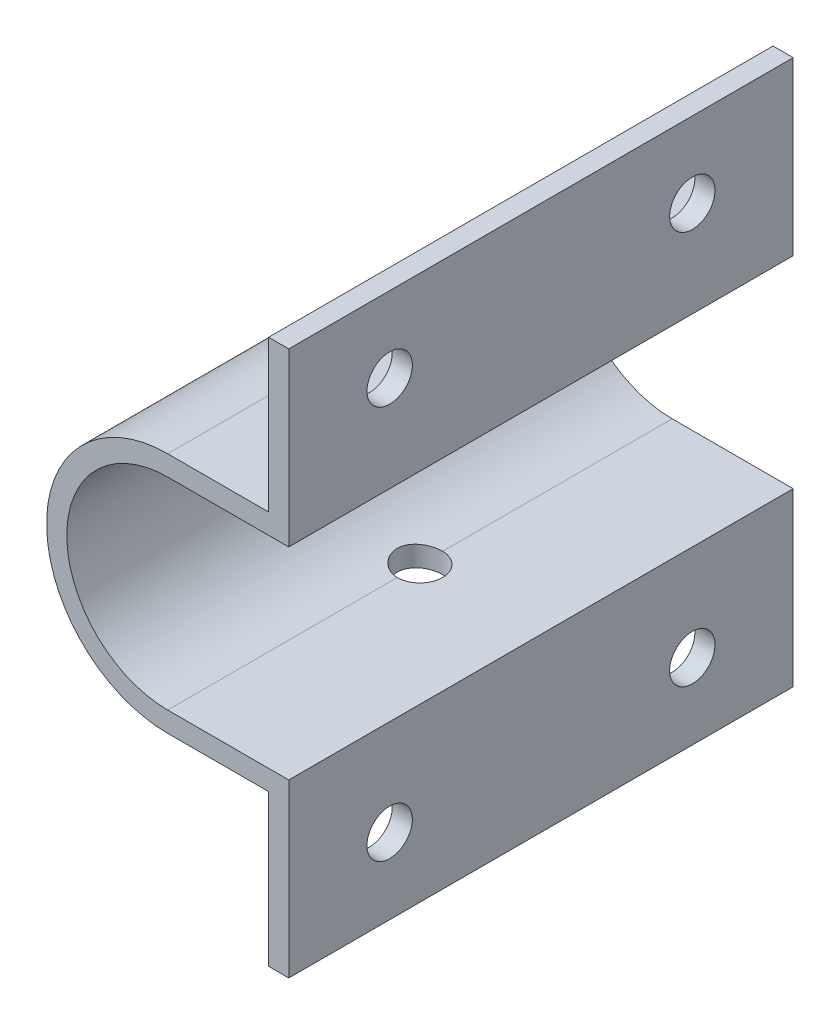
ISO-10303-21;
HEADER;
FILE_DESCRIPTION(('STEP AP214'),'2;1');
FILE_NAME('part.step','',(''),(''),'','','');
FILE_SCHEMA(('AUTOMOTIVE_DESIGN { 1 0 10303 214 1 1 1 1 }'));
ENDSEC;
DATA;
#1=APPLICATION_CONTEXT('core data for automotive mechanical design processes');
#2=APPLICATION_PROTOCOL_DEFINITION('international standard','automotive_design',2000,#1);
#3=PRODUCT_CONTEXT('',#1,'mechanical');
#4=PRODUCT('Part','Part','',(#3));
#5=PRODUCT_RELATED_PRODUCT_CATEGORY('part','',(#4));
#6=PRODUCT_DEFINITION_FORMATION('','',#4);
#7=PRODUCT_DEFINITION_CONTEXT('part definition',#1,'design');
#8=PRODUCT_DEFINITION('design','',#6,#7);
#9=PRODUCT_DEFINITION_SHAPE('','',#8);
#10=(LENGTH_UNIT() NAMED_UNIT(*) SI_UNIT(.MILLI.,.METRE.));
#11=(NAMED_UNIT(*) PLANE_ANGLE_UNIT() SI_UNIT($,.RADIAN.));
#12=(NAMED_UNIT(*) SI_UNIT($,.STERADIAN.) SOLID_ANGLE_UNIT());
#13=UNCERTAINTY_MEASURE_WITH_UNIT(LENGTH_MEASURE(1.E-05),#10,'distance_accuracy_value','');
#14=(GEOMETRIC_REPRESENTATION_CONTEXT(3) GLOBAL_UNCERTAINTY_ASSIGNED_CONTEXT((#13)) GLOBAL_UNIT_ASSIGNED_CONTEXT((#10,
#11,#12)) REPRESENTATION_CONTEXT('',''));
#15=CARTESIAN_POINT('',(0.,0.,0.));
#16=DIRECTION('',(0.,0.,1.));
#17=DIRECTION('',(1.,0.,0.));
#18=AXIS2_PLACEMENT_3D('',#15,#16,#17);
#19=CARTESIAN_POINT('',(0.,0.,50.));
#20=DIRECTION('',(0.,0.,-1.));
#21=DIRECTION('',(-1.,0.,0.));
#22=AXIS2_PLACEMENT_3D('',#19,#20,#21);
#23=CYLINDRICAL_SURFACE('',#22,10.);
#24=DIRECTION('',(0.,0.,-1.));
#25=VECTOR('',#24,1.);
#26=CARTESIAN_POINT('',(0.,10.,50.));
#27=LINE('',#26,#25);
#28=CARTESIAN_POINT('',(0.,10.,22.75));
#29=VERTEX_POINT('',#28);
#30=CARTESIAN_POINT('',(0.,10.,0.));
#31=VERTEX_POINT('',#30);
#32=EDGE_CURVE('E188',#29,#31,#27,.T.);
#33=ORIENTED_EDGE('',*,*,#32,.F.);
#34=CARTESIAN_POINT('',(0.,10.,22.75));
#35=CARTESIAN_POINT('',(-0.0624470447693873,10.0000055875236,22.749993056378));
#36=CARTESIAN_POINT('',(-0.124890204381189,9.99941517885063,22.75259966788));
#37=CARTESIAN_POINT('',(-0.249314903291551,9.99708377835417,22.7629861519145));
#38=CARTESIAN_POINT('',(-0.311296504304625,9.9953429432515,22.7707653197984));
#39=CARTESIAN_POINT('',(-0.43425777653705,9.99075594710814,22.7914256683882));
#40=CARTESIAN_POINT('',(-0.495238960421022,9.98791165403444,22.8042982275767));
#41=CARTESIAN_POINT('',(-0.615857084081694,9.98120113497269,22.8350291660513));
#42=CARTESIAN_POINT('',(-0.675494015065229,9.97733490230192,22.8528875779413));
#43=CARTESIAN_POINT('',(-0.85176921545323,9.96435191523754,22.913757729114));
#44=CARTESIAN_POINT('',(-0.96587678485342,9.9538466954166,22.9640821551381));
#45=CARTESIAN_POINT('',(-1.18398334570549,9.93027011933023,23.082678485921));
#46=CARTESIAN_POINT('',(-1.28798073581531,9.91719835753943,23.1509532274906));
#47=CARTESIAN_POINT('',(-1.48472488474375,9.88967180925127,23.3047405357436));
#48=CARTESIAN_POINT('',(-1.57727887743453,9.8751991766953,23.3904969495237));
#49=CARTESIAN_POINT('',(-1.74682120879686,9.84662524765225,23.576293756852));
#50=CARTESIAN_POINT('',(-1.82380682487077,9.83252401649023,23.6763366436084));
#51=CARTESIAN_POINT('',(-1.96089210296835,9.80611277589258,23.8893141415649));
#52=CARTESIAN_POINT('',(-2.02078278329098,9.79382575368215,24.0023863861688));
#53=CARTESIAN_POINT('',(-2.12063238799091,9.77269362016971,24.2373067141751));
#54=CARTESIAN_POINT('',(-2.16059490853669,9.7638478879275,24.3591532096608));
#55=CARTESIAN_POINT('',(-2.21881227334637,9.75078233375005,24.6060535000212));
#56=CARTESIAN_POINT('',(-2.23741248910662,9.7464890018169,24.7310218831118));
#57=CARTESIAN_POINT('',(-2.2534515068273,9.74279371034671,24.9823763533231));
#58=CARTESIAN_POINT('',(-2.25089258067435,9.74339122567249,25.1087622867843));
#59=CARTESIAN_POINT('',(-2.22496268171188,9.74934383403241,25.3567755076587));
#60=CARTESIAN_POINT('',(-2.20199539269521,9.75460664134083,25.4784475530561));
#61=CARTESIAN_POINT('',(-2.13654131808084,9.76915066186977,25.716165024114));
#62=CARTESIAN_POINT('',(-2.09405353824206,9.77843207976962,25.8322101628452));
#63=CARTESIAN_POINT('',(-1.99039842085379,9.80005744689505,26.0565072049556));
#64=CARTESIAN_POINT('',(-1.92907726476226,9.81242645163413,26.1646855067948));
#65=CARTESIAN_POINT('',(-1.78960562354948,9.83881772235586,26.3693621599014));
#66=CARTESIAN_POINT('',(-1.71145319075238,9.8528401795871,26.4658591574154));
#67=CARTESIAN_POINT('',(-1.5384205131291,9.88135157232016,26.6467488854991));
#68=CARTESIAN_POINT('',(-1.44319932003341,9.8958438517127,26.7308152489221));
#69=CARTESIAN_POINT('',(-1.23981483487394,9.92337497835629,26.8818617423308));
#70=CARTESIAN_POINT('',(-1.13164814687247,9.9364134424937,26.9488373744806));
#71=CARTESIAN_POINT('',(-0.905016126185512,9.95961628043603,27.0638922231609));
#72=CARTESIAN_POINT('',(-0.786521878712491,9.9697722224126,27.1119161597681));
#73=CARTESIAN_POINT('',(-0.542938875950985,9.98599221595876,27.187215639982));
#74=CARTESIAN_POINT('',(-0.41786010750347,9.99206228222466,27.2145216893455));
#75=CARTESIAN_POINT('',(-0.24311861911662,9.99716264034244,27.2373609736939));
#76=CARTESIAN_POINT('',(-0.194579933548807,9.99822543794932,27.2421019511106));
#77=CARTESIAN_POINT('',(-0.0973683045684508,9.99964360487849,27.2484176461227));
#78=CARTESIAN_POINT('',(-0.048695722034941,10.0000001557245,27.2499976519467));
#79=CARTESIAN_POINT('',(0.,10.,27.25));
#80=B_SPLINE_CURVE_WITH_KNOTS('',3,(#34,#35,#36,#37,#38,#39,#40,#41,#42,#43,#44,#45,#46,#47,#48,
#49,#50,#51,#52,#53,#54,#55,#56,#57,#58,#59,#60,#61,#62,#63,#64,#65,#66,#67,#68,#69,#70,#71,#72,
#73,#74,#75,#76,#77,#78,#79),.UNSPECIFIED.,.F.,.F.,(4,2,2,2,2,2,2,2,2,2,2,2,2,2,2,2,2,2,2,2,2,2,
4),(0.,0.187277202892288,0.374528898555835,0.561464982402661,0.748402288700246,1.12196151235232,
1.49557980763684,1.87481816023406,2.25412277678858,2.63788306436369,3.02157407476856,
3.39897040951183,3.77632622320964,4.14637997506813,4.51645257703843,4.88963189781835,
5.26285442525904,5.64459155600461,6.02642904666238,6.40937222367941,6.79175044133717,
6.93800948964249,7.08402364480622),.UNSPECIFIED.);
#81=CARTESIAN_POINT('',(0.,10.,27.25));
#82=VERTEX_POINT('',#81);
#83=EDGE_CURVE('E48',#29,#82,#80,.T.);
#84=ORIENTED_EDGE('',*,*,#83,.T.);
#85=CARTESIAN_POINT('',(0.,10.,50.));
#86=VERTEX_POINT('',#85);
#87=EDGE_CURVE('E42',#86,#82,#27,.T.);
#88=ORIENTED_EDGE('',*,*,#87,.F.);
#89=CARTESIAN_POINT('',(0.,0.,50.));
#90=DIRECTION('',(0.,0.,-1.));
#91=DIRECTION('',(1.,0.,0.));
#92=AXIS2_PLACEMENT_3D('',#89,#90,#91);
#93=CIRCLE('',#92,10.);
#94=CARTESIAN_POINT('',(0.,-10.,50.));
#95=VERTEX_POINT('',#94);
#96=EDGE_CURVE('E239',#95,#86,#93,.T.);
#97=ORIENTED_EDGE('',*,*,#96,.F.);
#98=DIRECTION('',(0.,0.,-1.));
#99=VECTOR('',#98,1.);
#100=CARTESIAN_POINT('',(0.,-10.,50.));
#101=LINE('',#100,#99);
#102=CARTESIAN_POINT('',(0.,-10.,27.25));
#103=VERTEX_POINT('',#102);
#104=EDGE_CURVE('E240',#95,#103,#101,.T.);
#105=ORIENTED_EDGE('',*,*,#104,.T.);
#106=CARTESIAN_POINT('',(0.,-10.,27.25));
#107=CARTESIAN_POINT('',(-0.0624470447693843,-10.0000055875236,27.250006943622));
#108=CARTESIAN_POINT('',(-0.124890204381186,-9.99941517885063,27.24740033212));
#109=CARTESIAN_POINT('',(-0.249314903291548,-9.99708377835417,27.2370138480855));
#110=CARTESIAN_POINT('',(-0.311296504304622,-9.9953429432515,27.2292346802017));
#111=CARTESIAN_POINT('',(-0.434257776537047,-9.99075594710814,27.2085743316118));
#112=CARTESIAN_POINT('',(-0.495238960421019,-9.98791165403444,27.1957017724233));
#113=CARTESIAN_POINT('',(-0.615857084081691,-9.98120113497269,27.1649708339487));
#114=CARTESIAN_POINT('',(-0.675494015065226,-9.97733490230192,27.1471124220587));
#115=CARTESIAN_POINT('',(-0.851769215453227,-9.96435191523754,27.086242270886));
#116=CARTESIAN_POINT('',(-0.965876784853417,-9.9538466954166,27.0359178448619));
#117=CARTESIAN_POINT('',(-1.18398334570548,-9.93027011933023,26.917321514079));
#118=CARTESIAN_POINT('',(-1.28798073581531,-9.91719835753943,26.8490467725094));
#119=CARTESIAN_POINT('',(-1.48472488474375,-9.88967180925127,26.6952594642564));
#120=CARTESIAN_POINT('',(-1.57727887743453,-9.8751991766953,26.6095030504763));
#121=CARTESIAN_POINT('',(-1.74682120879686,-9.84662524765225,26.423706243148));
#122=CARTESIAN_POINT('',(-1.82380682487076,-9.83252401649023,26.3236633563916));
#123=CARTESIAN_POINT('',(-1.96089210296834,-9.80611277589259,26.1106858584351));
#124=CARTESIAN_POINT('',(-2.02078278329098,-9.79382575368215,25.9976136138312));
#125=CARTESIAN_POINT('',(-2.12063238799091,-9.77269362016971,25.7626932858249));
#126=CARTESIAN_POINT('',(-2.16059490853669,-9.76384788792751,25.6408467903392));
#127=CARTESIAN_POINT('',(-2.21881227334637,-9.75078233375005,25.3939464999788));
#128=CARTESIAN_POINT('',(-2.23741248910662,-9.7464890018169,25.2689781168882));
#129=CARTESIAN_POINT('',(-2.2534515068273,-9.74279371034671,25.0176236466769));
#130=CARTESIAN_POINT('',(-2.25089258067435,-9.74339122567249,24.8912377132157));
#131=CARTESIAN_POINT('',(-2.22496268171188,-9.74934383403241,24.6432244923413));
#132=CARTESIAN_POINT('',(-2.20199539269521,-9.75460664134083,24.5215524469439));
#133=CARTESIAN_POINT('',(-2.13654131808084,-9.76915066186977,24.283834975886));
#134=CARTESIAN_POINT('',(-2.09405353824207,-9.77843207976962,24.1677898371548));
#135=CARTESIAN_POINT('',(-1.99039842085379,-9.80005744689505,23.9434927950444));
#136=CARTESIAN_POINT('',(-1.92907726476226,-9.81242645163413,23.8353144932052));
#137=CARTESIAN_POINT('',(-1.78960562354948,-9.83881772235586,23.6306378400986));
#138=CARTESIAN_POINT('',(-1.71145319075238,-9.8528401795871,23.5341408425846));
#139=CARTESIAN_POINT('',(-1.5384205131291,-9.88135157232016,23.3532511145009));
#140=CARTESIAN_POINT('',(-1.44319932003341,-9.8958438517127,23.2691847510779));
#141=CARTESIAN_POINT('',(-1.23981483487394,-9.92337497835629,23.1181382576692));
#142=CARTESIAN_POINT('',(-1.13164814687248,-9.9364134424937,23.0511626255194));
#143=CARTESIAN_POINT('',(-0.905016126185516,-9.95961628043603,22.9361077768391));
#144=CARTESIAN_POINT('',(-0.786521878712495,-9.9697722224126,22.8880838402319));
#145=CARTESIAN_POINT('',(-0.542938875950989,-9.98599221595876,22.812784360018));
#146=CARTESIAN_POINT('',(-0.417860107503474,-9.99206228222466,22.7854783106545));
#147=CARTESIAN_POINT('',(-0.243118619116623,-9.99716264034244,22.7626390263061));
#148=CARTESIAN_POINT('',(-0.194579933548809,-9.99822543794932,22.7578980488894));
#149=CARTESIAN_POINT('',(-0.0973683045684507,-9.99964360487849,22.7515823538773));
#150=CARTESIAN_POINT('',(-0.0486957220349397,-10.0000001557245,22.7500023480533));
#151=CARTESIAN_POINT('',(0.,-10.,22.75));
#152=B_SPLINE_CURVE_WITH_KNOTS('',3,(#106,#107,#108,#109,#110,#111,#112,#113,#114,#115,#116,
#117,#118,#119,#120,#121,#122,#123,#124,#125,#126,#127,#128,#129,#130,#131,#132,#133,#134,#135,
#136,#137,#138,#139,#140,#141,#142,#143,#144,#145,#146,#147,#148,#149,#150,#151),.UNSPECIFIED.,
.F.,.F.,(4,2,2,2,2,2,2,2,2,2,2,2,2,2,2,2,2,2,2,2,2,2,4),(0.,0.187277202892288,0.374528898555834,
0.561464982402661,0.748402288700246,1.12196151235232,1.49557980763683,1.87481816023405,
2.25412277678858,2.63788306436368,3.02157407476856,3.39897040951183,3.77632622320964,
4.14637997506813,4.51645257703843,4.88963189781835,5.26285442525905,5.64459155600462,
6.02642904666238,6.40937222367941,6.79175044133717,6.93800948964249,7.08402364480623),.UNSPECIFIED.);
#153=CARTESIAN_POINT('',(0.,-10.,22.75));
#154=VERTEX_POINT('',#153);
#155=EDGE_CURVE('E153',#103,#154,#152,.T.);
#156=ORIENTED_EDGE('',*,*,#155,.T.);
#157=CARTESIAN_POINT('',(0.,-10.,0.));
#158=VERTEX_POINT('',#157);
#159=EDGE_CURVE('E211',#154,#158,#101,.T.);
#160=ORIENTED_EDGE('',*,*,#159,.T.);
#161=CARTESIAN_POINT('',(0.,0.,0.));
#162=DIRECTION('',(0.,0.,-1.));
#163=DIRECTION('',(1.,0.,0.));
#164=AXIS2_PLACEMENT_3D('',#161,#162,#163);
#165=CIRCLE('',#164,10.);
#166=EDGE_CURVE('E205',#158,#31,#165,.T.);
#167=ORIENTED_EDGE('',*,*,#166,.T.);
#168=EDGE_LOOP('',(#33,#84,#88,#97,#105,#156,#160,#167));
#169=FACE_BOUND('',#168,.T.);
#170=ADVANCED_FACE('F34',(#169),#23,.F.);
#171=CARTESIAN_POINT('',(12.,10.,50.));
#172=DIRECTION('',(0.,1.,0.));
#173=DIRECTION('',(0.,0.,1.));
#174=AXIS2_PLACEMENT_3D('',#171,#172,#173);
#175=PLANE('',#174);
#176=ORIENTED_EDGE('',*,*,#87,.T.);
#177=CARTESIAN_POINT('',(0.,10.,25.));
#178=DIRECTION('',(0.,1.,0.));
#179=DIRECTION('',(0.,0.,1.));
#180=AXIS2_PLACEMENT_3D('',#177,#178,#179);
#181=CIRCLE('',#180,2.25);
#182=EDGE_CURVE('E197',#82,#29,#181,.T.);
#183=ORIENTED_EDGE('',*,*,#182,.T.);
#184=ORIENTED_EDGE('',*,*,#32,.T.);
#185=DIRECTION('',(1.,0.,0.));
#186=VECTOR('',#185,1.);
#187=CARTESIAN_POINT('',(12.,10.,0.));
#188=LINE('',#187,#186);
#189=CARTESIAN_POINT('',(12.,10.,0.));
#190=VERTEX_POINT('',#189);
#191=EDGE_CURVE('E196',#31,#190,#188,.T.);
#192=ORIENTED_EDGE('',*,*,#191,.T.);
#193=DIRECTION('',(0.,0.,-1.));
#194=VECTOR('',#193,1.);
#195=CARTESIAN_POINT('',(12.,10.,50.));
#196=LINE('',#195,#194);
#197=CARTESIAN_POINT('',(12.,10.,50.));
#198=VERTEX_POINT('',#197);
#199=EDGE_CURVE('E186',#198,#190,#196,.T.);
#200=ORIENTED_EDGE('',*,*,#199,.F.);
#201=DIRECTION('',(1.,0.,0.));
#202=VECTOR('',#201,1.);
#203=CARTESIAN_POINT('',(12.,10.,50.));
#204=LINE('',#203,#202);
#205=EDGE_CURVE('E287',#86,#198,#204,.T.);
#206=ORIENTED_EDGE('',*,*,#205,.F.);
#207=EDGE_LOOP('',(#176,#183,#184,#192,#200,#206));
#208=FACE_BOUND('',#207,.T.);
#209=ADVANCED_FACE('F194',(#208),#175,.F.);
#210=CARTESIAN_POINT('',(12.,27.,50.));
#211=DIRECTION('',(-1.,0.,0.));
#212=DIRECTION('',(0.,-1.,0.));
#213=AXIS2_PLACEMENT_3D('',#210,#211,#212);
#214=PLANE('',#213);
#215=CARTESIAN_POINT('',(12.,19.5,40.));
#216=DIRECTION('',(-1.,0.,0.));
#217=DIRECTION('',(0.,-1.,0.));
#218=AXIS2_PLACEMENT_3D('',#215,#216,#217);
#219=CIRCLE('',#218,2.25);
#220=CARTESIAN_POINT('',(12.,17.25,40.));
#221=VERTEX_POINT('',#220);
#222=EDGE_CURVE('E483',#221,#221,#219,.F.);
#223=ORIENTED_EDGE('',*,*,#222,.F.);
#224=EDGE_LOOP('',(#223));
#225=FACE_BOUND('',#224,.T.);
#226=CARTESIAN_POINT('',(12.,19.5,10.));
#227=DIRECTION('',(-1.,0.,0.));
#228=DIRECTION('',(0.,-1.,0.));
#229=AXIS2_PLACEMENT_3D('',#226,#227,#228);
#230=CIRCLE('',#229,2.25);
#231=CARTESIAN_POINT('',(12.,17.25,10.));
#232=VERTEX_POINT('',#231);
#233=EDGE_CURVE('E487',#232,#232,#230,.F.);
#234=ORIENTED_EDGE('',*,*,#233,.F.);
#235=EDGE_LOOP('',(#234));
#236=FACE_BOUND('',#235,.T.);
#237=DIRECTION('',(0.,1.,0.));
#238=VECTOR('',#237,1.);
#239=CARTESIAN_POINT('',(12.,27.,0.));
#240=LINE('',#239,#238);
#241=CARTESIAN_POINT('',(12.,27.,0.));
#242=VERTEX_POINT('',#241);
#243=EDGE_CURVE('E207',#190,#242,#240,.T.);
#244=ORIENTED_EDGE('',*,*,#243,.T.);
#245=DIRECTION('',(0.,0.,-1.));
#246=VECTOR('',#245,1.);
#247=CARTESIAN_POINT('',(12.,27.,50.));
#248=LINE('',#247,#246);
#249=CARTESIAN_POINT('',(12.,27.,50.));
#250=VERTEX_POINT('',#249);
#251=EDGE_CURVE('E183',#250,#242,#248,.T.);
#252=ORIENTED_EDGE('',*,*,#251,.F.);
#253=DIRECTION('',(0.,1.,0.));
#254=VECTOR('',#253,1.);
#255=CARTESIAN_POINT('',(12.,27.,50.));
#256=LINE('',#255,#254);
#257=EDGE_CURVE('E285',#198,#250,#256,.T.);
#258=ORIENTED_EDGE('',*,*,#257,.F.);
#259=ORIENTED_EDGE('',*,*,#199,.T.);
#260=EDGE_LOOP('',(#244,#252,#258,#259));
#261=FACE_BOUND('',#260,.T.);
#262=ADVANCED_FACE('F341',(#225,#236,#261),#214,.F.);
#263=CARTESIAN_POINT('',(10.,27.,50.));
#264=DIRECTION('',(0.,-1.,0.));
#265=DIRECTION('',(0.,0.,-1.));
#266=AXIS2_PLACEMENT_3D('',#263,#264,#265);
#267=PLANE('',#266);
#268=DIRECTION('',(-1.,0.,0.));
#269=VECTOR('',#268,1.);
#270=CARTESIAN_POINT('',(10.,27.,0.));
#271=LINE('',#270,#269);
#272=CARTESIAN_POINT('',(10.,27.,0.));
#273=VERTEX_POINT('',#272);
#274=EDGE_CURVE('E220',#242,#273,#271,.T.);
#275=ORIENTED_EDGE('',*,*,#274,.T.);
#276=DIRECTION('',(0.,0.,-1.));
#277=VECTOR('',#276,1.);
#278=CARTESIAN_POINT('',(10.,27.,50.));
#279=LINE('',#278,#277);
#280=CARTESIAN_POINT('',(10.,27.,50.));
#281=VERTEX_POINT('',#280);
#282=EDGE_CURVE('E180',#281,#273,#279,.T.);
#283=ORIENTED_EDGE('',*,*,#282,.F.);
#284=DIRECTION('',(-1.,0.,0.));
#285=VECTOR('',#284,1.);
#286=CARTESIAN_POINT('',(10.,27.,50.));
#287=LINE('',#286,#285);
#288=EDGE_CURVE('E283',#250,#281,#287,.T.);
#289=ORIENTED_EDGE('',*,*,#288,.F.);
#290=ORIENTED_EDGE('',*,*,#251,.T.);
#291=EDGE_LOOP('',(#275,#283,#289,#290));
#292=FACE_BOUND('',#291,.T.);
#293=ADVANCED_FACE('F337',(#292),#267,.F.);
#294=CARTESIAN_POINT('',(10.,12.,50.));
#295=DIRECTION('',(1.,0.,0.));
#296=DIRECTION('',(0.,0.,-1.));
#297=AXIS2_PLACEMENT_3D('',#294,#295,#296);
#298=PLANE('',#297);
#299=CARTESIAN_POINT('',(10.,19.5,40.));
#300=DIRECTION('',(-1.,0.,0.));
#301=DIRECTION('',(0.,0.,1.));
#302=AXIS2_PLACEMENT_3D('',#299,#300,#301);
#303=CIRCLE('',#302,2.25);
#304=CARTESIAN_POINT('',(10.,19.5,42.25));
#305=VERTEX_POINT('',#304);
#306=EDGE_CURVE('E480',#305,#305,#303,.T.);
#307=ORIENTED_EDGE('',*,*,#306,.F.);
#308=EDGE_LOOP('',(#307));
#309=FACE_BOUND('',#308,.T.);
#310=CARTESIAN_POINT('',(10.,19.5,10.));
#311=DIRECTION('',(-1.,0.,0.));
#312=DIRECTION('',(0.,0.,1.));
#313=AXIS2_PLACEMENT_3D('',#310,#311,#312);
#314=CIRCLE('',#313,2.25);
#315=CARTESIAN_POINT('',(10.,19.5,12.25));
#316=VERTEX_POINT('',#315);
#317=EDGE_CURVE('E484',#316,#316,#314,.T.);
#318=ORIENTED_EDGE('',*,*,#317,.F.);
#319=EDGE_LOOP('',(#318));
#320=FACE_BOUND('',#319,.T.);
#321=DIRECTION('',(0.,-1.,0.));
#322=VECTOR('',#321,1.);
#323=CARTESIAN_POINT('',(10.,12.,0.));
#324=LINE('',#323,#322);
#325=CARTESIAN_POINT('',(10.,12.,0.));
#326=VERTEX_POINT('',#325);
#327=EDGE_CURVE('E222',#273,#326,#324,.T.);
#328=ORIENTED_EDGE('',*,*,#327,.T.);
#329=DIRECTION('',(0.,0.,-1.));
#330=VECTOR('',#329,1.);
#331=CARTESIAN_POINT('',(10.,12.,50.));
#332=LINE('',#331,#330);
#333=CARTESIAN_POINT('',(10.,12.,50.));
#334=VERTEX_POINT('',#333);
#335=EDGE_CURVE('E177',#334,#326,#332,.T.);
#336=ORIENTED_EDGE('',*,*,#335,.F.);
#337=DIRECTION('',(0.,-1.,0.));
#338=VECTOR('',#337,1.);
#339=CARTESIAN_POINT('',(10.,12.,50.));
#340=LINE('',#339,#338);
#341=EDGE_CURVE('E281',#281,#334,#340,.T.);
#342=ORIENTED_EDGE('',*,*,#341,.F.);
#343=ORIENTED_EDGE('',*,*,#282,.T.);
#344=EDGE_LOOP('',(#328,#336,#342,#343));
#345=FACE_BOUND('',#344,.T.);
#346=ADVANCED_FACE('F333',(#309,#320,#345),#298,.F.);
#347=CARTESIAN_POINT('',(0.,12.,50.));
#348=DIRECTION('',(0.,-1.,0.));
#349=DIRECTION('',(0.,0.,-1.));
#350=AXIS2_PLACEMENT_3D('',#347,#348,#349);
#351=PLANE('',#350);
#352=DIRECTION('',(0.,0.,-1.));
#353=VECTOR('',#352,1.);
#354=CARTESIAN_POINT('',(0.,12.,50.));
#355=LINE('',#354,#353);
#356=CARTESIAN_POINT('',(0.,12.,22.75));
#357=VERTEX_POINT('',#356);
#358=CARTESIAN_POINT('',(0.,12.,0.));
#359=VERTEX_POINT('',#358);
#360=EDGE_CURVE('E169',#357,#359,#355,.T.);
#361=ORIENTED_EDGE('',*,*,#360,.F.);
#362=CARTESIAN_POINT('',(0.,12.,25.));
#363=DIRECTION('',(0.,1.,0.));
#364=DIRECTION('',(0.,0.,1.));
#365=AXIS2_PLACEMENT_3D('',#362,#363,#364);
#366=CIRCLE('',#365,2.25);
#367=CARTESIAN_POINT('',(0.,12.,27.25));
#368=VERTEX_POINT('',#367);
#369=EDGE_CURVE('E55',#368,#357,#366,.T.);
#370=ORIENTED_EDGE('',*,*,#369,.F.);
#371=CARTESIAN_POINT('',(0.,12.,50.));
#372=VERTEX_POINT('',#371);
#373=EDGE_CURVE('E171',#372,#368,#355,.T.);
#374=ORIENTED_EDGE('',*,*,#373,.F.);
#375=DIRECTION('',(-1.,0.,0.));
#376=VECTOR('',#375,1.);
#377=CARTESIAN_POINT('',(0.,12.,50.));
#378=LINE('',#377,#376);
#379=EDGE_CURVE('E279',#334,#372,#378,.T.);
#380=ORIENTED_EDGE('',*,*,#379,.F.);
#381=ORIENTED_EDGE('',*,*,#335,.T.);
#382=DIRECTION('',(-1.,0.,0.));
#383=VECTOR('',#382,1.);
#384=CARTESIAN_POINT('',(0.,12.,0.));
#385=LINE('',#384,#383);
#386=EDGE_CURVE('E224',#326,#359,#385,.T.);
#387=ORIENTED_EDGE('',*,*,#386,.T.);
#388=EDGE_LOOP('',(#361,#370,#374,#380,#381,#387));
#389=FACE_BOUND('',#388,.T.);
#390=ADVANCED_FACE('F328',(#389),#351,.F.);
#391=CARTESIAN_POINT('',(0.,0.,50.));
#392=DIRECTION('',(0.,0.,-1.));
#393=DIRECTION('',(-1.,0.,0.));
#394=AXIS2_PLACEMENT_3D('',#391,#392,#393);
#395=CYLINDRICAL_SURFACE('',#394,12.);
#396=ORIENTED_EDGE('',*,*,#373,.T.);
#397=CARTESIAN_POINT('',(0.,12.,27.25));
#398=CARTESIAN_POINT('',(-0.0627176474770845,12.0000027243293,27.2500002162742));
#399=CARTESIAN_POINT('',(-0.125404727547508,11.9995076996169,27.2473760023022));
#400=CARTESIAN_POINT('',(-0.250319842136592,11.9975511003661,27.2369111257716));
#401=CARTESIAN_POINT('',(-0.312547926509069,11.9960896324089,27.2290710384288));
#402=CARTESIAN_POINT('',(-0.497685129882004,11.9903076344713,27.1978224027609));
#403=CARTESIAN_POINT('',(-0.619337519768249,11.9845892489102,27.1666851338981));
#404=CARTESIAN_POINT('',(-0.855572793785437,11.9700478717485,27.0847428116026));
#405=CARTESIAN_POINT('',(-0.97015445944237,11.9612243467961,27.0339343792172));
#406=CARTESIAN_POINT('',(-1.18919179952298,11.9414370909219,26.9141314426395));
#407=CARTESIAN_POINT('',(-1.29364690204252,11.9304732392291,26.8451359121366));
#408=CARTESIAN_POINT('',(-1.49067264883699,11.9074705929924,26.6900538218665));
#409=CARTESIAN_POINT('',(-1.58310543116731,11.8954216269843,26.6037936831522));
#410=CARTESIAN_POINT('',(-1.75228666351659,11.8716808379856,26.4169942231759));
#411=CARTESIAN_POINT('',(-1.82903255918503,11.8599890734226,26.3164525809174));
#412=CARTESIAN_POINT('',(-1.96522701957414,11.8381879624659,26.1029678468605));
#413=CARTESIAN_POINT('',(-2.02453419221267,11.8280918424152,25.989933085605));
#414=CARTESIAN_POINT('',(-2.12326005245413,11.8107702903569,25.7552897955961));
#415=CARTESIAN_POINT('',(-2.16268156830397,11.8035444501535,25.6336824888828));
#416=CARTESIAN_POINT('',(-2.22007547243605,11.7928841066388,25.3868286059919));
#417=CARTESIAN_POINT('',(-2.23829042656123,11.7894067619173,25.2616403135222));
#418=CARTESIAN_POINT('',(-2.25350718814736,11.7865079443625,25.0099369109428));
#419=CARTESIAN_POINT('',(-2.25051039862343,11.787086203278,24.8834218891399));
#420=CARTESIAN_POINT('',(-2.22358465060628,11.7921943992544,24.634420280414));
#421=CARTESIAN_POINT('',(-2.19993209385028,11.7966721536582,24.5119025761068));
#422=CARTESIAN_POINT('',(-2.13280168028389,11.8089928034254,24.2726065590068));
#423=CARTESIAN_POINT('',(-2.08932311837518,11.8168358184714,24.1558284505025));
#424=CARTESIAN_POINT('',(-1.98350383191203,11.8350579864678,23.9305150473425));
#425=CARTESIAN_POINT('',(-1.92105118634522,11.8454521156076,23.82203357835));
#426=CARTESIAN_POINT('',(-1.7791376751133,11.8675949767358,23.616989578747));
#427=CARTESIAN_POINT('',(-1.69967566529416,11.8793437998247,23.5204278506205));
#428=CARTESIAN_POINT('',(-1.52452076518373,11.9030984369892,23.3403746141233));
#429=CARTESIAN_POINT('',(-1.42859341512596,11.9151053961594,23.2571111977271));
#430=CARTESIAN_POINT('',(-1.22397914461817,11.9378579166824,23.1078016212217));
#431=CARTESIAN_POINT('',(-1.11528872582181,11.9486031305702,23.0417601976975));
#432=CARTESIAN_POINT('',(-0.887980502236274,11.9676447448319,22.9287345612218));
#433=CARTESIAN_POINT('',(-0.769345118536121,11.9759366864117,22.8817849902249));
#434=CARTESIAN_POINT('',(-0.52576015358451,11.9890941407329,22.8086091738474));
#435=CARTESIAN_POINT('',(-0.400820224684147,11.9939647306556,22.7823522141744));
#436=CARTESIAN_POINT('',(-0.229084071533211,11.997900938115,22.7612183752224));
#437=CARTESIAN_POINT('',(-0.18333152822611,11.9986873639803,22.7570098808943));
#438=CARTESIAN_POINT('',(-0.0917261154339084,11.9997364034906,22.7514042835294));
#439=CARTESIAN_POINT('',(-0.045873546153056,11.9999999000897,22.7500024414897));
#440=CARTESIAN_POINT('',(0.,12.,22.75));
#441=B_SPLINE_CURVE_WITH_KNOTS('',3,(#397,#398,#399,#400,#401,#402,#403,#404,#405,#406,#407,
#408,#409,#410,#411,#412,#413,#414,#415,#416,#417,#418,#419,#420,#421,#422,#423,#424,#425,#426,
#427,#428,#429,#430,#431,#432,#433,#434,#435,#436,#437,#438,#439,#440),.UNSPECIFIED.,.F.,.F.,(4,
2,2,2,2,2,2,2,2,2,2,2,2,2,2,2,2,2,2,2,2,4),(0.,0.188035695705097,0.376050657936426,
0.75122085459739,1.12645552355794,1.50171137180651,1.88094892710281,2.26024818586612,
2.6425429550051,3.02478333674935,3.40260721643803,3.78040610583499,4.15322569270442,
4.52605853968155,4.90113475219391,5.27623620256271,5.65720549403428,6.03827945369134,
6.42004181518653,6.80123644929904,6.93902592420529,7.07658254615665),.UNSPECIFIED.);
#442=EDGE_CURVE('E164',#368,#357,#441,.T.);
#443=ORIENTED_EDGE('',*,*,#442,.T.);
#444=ORIENTED_EDGE('',*,*,#360,.T.);
#445=CARTESIAN_POINT('',(0.,0.,0.));
#446=DIRECTION('',(0.,0.,1.));
#447=DIRECTION('',(1.,0.,0.));
#448=AXIS2_PLACEMENT_3D('',#445,#446,#447);
#449=CIRCLE('',#448,12.);
#450=CARTESIAN_POINT('',(0.,-12.,0.));
#451=VERTEX_POINT('',#450);
#452=EDGE_CURVE('E227',#359,#451,#449,.T.);
#453=ORIENTED_EDGE('',*,*,#452,.T.);
#454=DIRECTION('',(0.,0.,-1.));
#455=VECTOR('',#454,1.);
#456=CARTESIAN_POINT('',(0.,-12.,50.));
#457=LINE('',#456,#455);
#458=CARTESIAN_POINT('',(0.,-12.,22.75));
#459=VERTEX_POINT('',#458);
#460=EDGE_CURVE('E163',#459,#451,#457,.T.);
#461=ORIENTED_EDGE('',*,*,#460,.F.);
#462=CARTESIAN_POINT('',(0.,-12.,22.75));
#463=CARTESIAN_POINT('',(-0.0627176474770813,-12.0000027243293,22.7499997837258));
#464=CARTESIAN_POINT('',(-0.125404727547504,-11.9995076996169,22.7526239976978));
#465=CARTESIAN_POINT('',(-0.250319842136588,-11.9975511003661,22.7630888742284));
#466=CARTESIAN_POINT('',(-0.312547926509066,-11.9960896324089,22.7709289615712));
#467=CARTESIAN_POINT('',(-0.497685129882,-11.9903076344713,22.8021775972391));
#468=CARTESIAN_POINT('',(-0.619337519768245,-11.9845892489102,22.8333148661019));
#469=CARTESIAN_POINT('',(-0.855572793785433,-11.9700478717485,22.9152571883974));
#470=CARTESIAN_POINT('',(-0.970154459442367,-11.9612243467961,22.9660656207828));
#471=CARTESIAN_POINT('',(-1.18919179952298,-11.9414370909219,23.0858685573605));
#472=CARTESIAN_POINT('',(-1.29364690204252,-11.9304732392291,23.1548640878634));
#473=CARTESIAN_POINT('',(-1.49067264883699,-11.9074705929924,23.3099461781335));
#474=CARTESIAN_POINT('',(-1.5831054311673,-11.8954216269843,23.3962063168478));
#475=CARTESIAN_POINT('',(-1.75228666351659,-11.8716808379856,23.5830057768241));
#476=CARTESIAN_POINT('',(-1.82903255918503,-11.8599890734226,23.6835474190826));
#477=CARTESIAN_POINT('',(-1.96522701957413,-11.8381879624659,23.8970321531395));
#478=CARTESIAN_POINT('',(-2.02453419221266,-11.8280918424152,24.010066914395));
#479=CARTESIAN_POINT('',(-2.12326005245413,-11.8107702903569,24.2447102044039));
#480=CARTESIAN_POINT('',(-2.16268156830397,-11.8035444501535,24.3663175111172));
#481=CARTESIAN_POINT('',(-2.22007547243605,-11.7928841066388,24.6131713940081));
#482=CARTESIAN_POINT('',(-2.23829042656123,-11.7894067619173,24.7383596864778));
#483=CARTESIAN_POINT('',(-2.25350718814736,-11.7865079443625,24.9900630890572));
#484=CARTESIAN_POINT('',(-2.25051039862343,-11.787086203278,25.1165781108601));
#485=CARTESIAN_POINT('',(-2.22358465060628,-11.7921943992544,25.365579719586));
#486=CARTESIAN_POINT('',(-2.19993209385028,-11.7966721536582,25.4880974238932));
#487=CARTESIAN_POINT('',(-2.13280168028389,-11.8089928034254,25.7273934409932));
#488=CARTESIAN_POINT('',(-2.08932311837518,-11.8168358184714,25.8441715494975));
#489=CARTESIAN_POINT('',(-1.98350383191204,-11.8350579864678,26.0694849526575));
#490=CARTESIAN_POINT('',(-1.92105118634523,-11.8454521156076,26.17796642165));
#491=CARTESIAN_POINT('',(-1.7791376751133,-11.8675949767358,26.383010421253));
#492=CARTESIAN_POINT('',(-1.69967566529416,-11.8793437998246,26.4795721493795));
#493=CARTESIAN_POINT('',(-1.52452076518374,-11.9030984369892,26.6596253858767));
#494=CARTESIAN_POINT('',(-1.42859341512597,-11.9151053961594,26.7428888022729));
#495=CARTESIAN_POINT('',(-1.22397914461817,-11.9378579166824,26.8921983787783));
#496=CARTESIAN_POINT('',(-1.11528872582181,-11.9486031305702,26.9582398023025));
#497=CARTESIAN_POINT('',(-0.887980502236275,-11.9676447448319,27.0712654387782));
#498=CARTESIAN_POINT('',(-0.769345118536123,-11.9759366864117,27.1182150097751));
#499=CARTESIAN_POINT('',(-0.525760153584513,-11.9890941407329,27.1913908261526));
#500=CARTESIAN_POINT('',(-0.400820224684149,-11.9939647306557,27.2176477858256));
#501=CARTESIAN_POINT('',(-0.229084071533213,-11.997900938115,27.2387816247776));
#502=CARTESIAN_POINT('',(-0.183331528226111,-11.9986873639803,27.2429901191057));
#503=CARTESIAN_POINT('',(-0.0917261154339087,-11.9997364034906,27.2485957164706));
#504=CARTESIAN_POINT('',(-0.0458735461530558,-11.9999999000897,27.2499975585103));
#505=CARTESIAN_POINT('',(0.,-12.,27.25));
#506=B_SPLINE_CURVE_WITH_KNOTS('',3,(#462,#463,#464,#465,#466,#467,#468,#469,#470,#471,#472,
#473,#474,#475,#476,#477,#478,#479,#480,#481,#482,#483,#484,#485,#486,#487,#488,#489,#490,#491,
#492,#493,#494,#495,#496,#497,#498,#499,#500,#501,#502,#503,#504,#505),.UNSPECIFIED.,.F.,.F.,(4,
2,2,2,2,2,2,2,2,2,2,2,2,2,2,2,2,2,2,2,2,4),(0.,0.188035695705096,0.376050657936425,
0.751220854597391,1.12645552355794,1.5017113718065,1.88094892710281,2.26024818586612,
2.6425429550051,3.02478333674935,3.40260721643804,3.78040610583499,4.15322569270442,
4.52605853968155,4.90113475219391,5.27623620256271,5.65720549403429,6.03827945369134,
6.42004181518654,6.80123644929904,6.93902592420529,7.07658254615666),.UNSPECIFIED.);
#507=CARTESIAN_POINT('',(0.,-12.,27.25));
#508=VERTEX_POINT('',#507);
#509=EDGE_CURVE('E149',#459,#508,#506,.T.);
#510=ORIENTED_EDGE('',*,*,#509,.T.);
#511=CARTESIAN_POINT('',(0.,-12.,50.));
#512=VERTEX_POINT('',#511);
#513=EDGE_CURVE('E160',#512,#508,#457,.T.);
#514=ORIENTED_EDGE('',*,*,#513,.F.);
#515=CARTESIAN_POINT('',(0.,0.,50.));
#516=DIRECTION('',(0.,0.,1.));
#517=DIRECTION('',(1.,0.,0.));
#518=AXIS2_PLACEMENT_3D('',#515,#516,#517);
#519=CIRCLE('',#518,12.);
#520=EDGE_CURVE('E277',#372,#512,#519,.T.);
#521=ORIENTED_EDGE('',*,*,#520,.F.);
#522=EDGE_LOOP('',(#396,#443,#444,#453,#461,#510,#514,#521));
#523=FACE_BOUND('',#522,.T.);
#524=ADVANCED_FACE('F158',(#523),#395,.T.);
#525=CARTESIAN_POINT('',(10.,-12.,50.));
#526=DIRECTION('',(0.,1.,0.));
#527=DIRECTION('',(0.,0.,1.));
#528=AXIS2_PLACEMENT_3D('',#525,#526,#527);
#529=PLANE('',#528);
#530=ORIENTED_EDGE('',*,*,#513,.T.);
#531=CARTESIAN_POINT('',(0.,-12.,25.));
#532=DIRECTION('',(0.,1.,0.));
#533=DIRECTION('',(0.,0.,1.));
#534=AXIS2_PLACEMENT_3D('',#531,#532,#533);
#535=CIRCLE('',#534,2.25);
#536=EDGE_CURVE('E146',#459,#508,#535,.F.);
#537=ORIENTED_EDGE('',*,*,#536,.F.);
#538=ORIENTED_EDGE('',*,*,#460,.T.);
#539=DIRECTION('',(1.,0.,0.));
#540=VECTOR('',#539,1.);
#541=CARTESIAN_POINT('',(10.,-12.,0.));
#542=LINE('',#541,#540);
#543=CARTESIAN_POINT('',(10.,-12.,0.));
#544=VERTEX_POINT('',#543);
#545=EDGE_CURVE('E229',#451,#544,#542,.T.);
#546=ORIENTED_EDGE('',*,*,#545,.T.);
#547=DIRECTION('',(0.,0.,-1.));
#548=VECTOR('',#547,1.);
#549=CARTESIAN_POINT('',(10.,-12.,50.));
#550=LINE('',#549,#548);
#551=CARTESIAN_POINT('',(10.,-12.,50.));
#552=VERTEX_POINT('',#551);
#553=EDGE_CURVE('E173',#552,#544,#550,.T.);
#554=ORIENTED_EDGE('',*,*,#553,.F.);
#555=DIRECTION('',(1.,0.,0.));
#556=VECTOR('',#555,1.);
#557=CARTESIAN_POINT('',(10.,-12.,50.));
#558=LINE('',#557,#556);
#559=EDGE_CURVE('E168',#512,#552,#558,.T.);
#560=ORIENTED_EDGE('',*,*,#559,.F.);
#561=EDGE_LOOP('',(#530,#537,#538,#546,#554,#560));
#562=FACE_BOUND('',#561,.T.);
#563=ADVANCED_FACE('F166',(#562),#529,.F.);
#564=CARTESIAN_POINT('',(10.,-27.,50.));
#565=DIRECTION('',(1.,0.,0.));
#566=DIRECTION('',(0.,1.,0.));
#567=AXIS2_PLACEMENT_3D('',#564,#565,#566);
#568=PLANE('',#567);
#569=CARTESIAN_POINT('',(10.,-19.5,10.));
#570=DIRECTION('',(-1.,0.,0.));
#571=DIRECTION('',(0.,0.,1.));
#572=AXIS2_PLACEMENT_3D('',#569,#570,#571);
#573=CIRCLE('',#572,2.25);
#574=CARTESIAN_POINT('',(10.,-19.5,12.25));
#575=VERTEX_POINT('',#574);
#576=EDGE_CURVE('E498',#575,#575,#573,.T.);
#577=ORIENTED_EDGE('',*,*,#576,.F.);
#578=EDGE_LOOP('',(#577));
#579=FACE_BOUND('',#578,.T.);
#580=CARTESIAN_POINT('',(10.,-19.5,40.));
#581=DIRECTION('',(-1.,0.,0.));
#582=DIRECTION('',(0.,0.,1.));
#583=AXIS2_PLACEMENT_3D('',#580,#581,#582);
#584=CIRCLE('',#583,2.25);
#585=CARTESIAN_POINT('',(10.,-19.5,42.25));
#586=VERTEX_POINT('',#585);
#587=EDGE_CURVE('E492',#586,#586,#584,.T.);
#588=ORIENTED_EDGE('',*,*,#587,.F.);
#589=EDGE_LOOP('',(#588));
#590=FACE_BOUND('',#589,.T.);
#591=DIRECTION('',(0.,-1.,0.));
#592=VECTOR('',#591,1.);
#593=CARTESIAN_POINT('',(10.,-27.,0.));
#594=LINE('',#593,#592);
#595=CARTESIAN_POINT('',(10.,-27.,0.));
#596=VERTEX_POINT('',#595);
#597=EDGE_CURVE('E231',#544,#596,#594,.T.);
#598=ORIENTED_EDGE('',*,*,#597,.T.);
#599=DIRECTION('',(0.,0.,-1.));
#600=VECTOR('',#599,1.);
#601=CARTESIAN_POINT('',(10.,-27.,50.));
#602=LINE('',#601,#600);
#603=CARTESIAN_POINT('',(10.,-27.,50.));
#604=VERTEX_POINT('',#603);
#605=EDGE_CURVE('E248',#604,#596,#602,.T.);
#606=ORIENTED_EDGE('',*,*,#605,.F.);
#607=DIRECTION('',(0.,-1.,0.));
#608=VECTOR('',#607,1.);
#609=CARTESIAN_POINT('',(10.,-27.,50.));
#610=LINE('',#609,#608);
#611=EDGE_CURVE('E259',#552,#604,#610,.T.);
#612=ORIENTED_EDGE('',*,*,#611,.F.);
#613=ORIENTED_EDGE('',*,*,#553,.T.);
#614=EDGE_LOOP('',(#598,#606,#612,#613));
#615=FACE_BOUND('',#614,.T.);
#616=ADVANCED_FACE('F258',(#579,#590,#615),#568,.F.);
#617=CARTESIAN_POINT('',(12.,-27.,50.));
#618=DIRECTION('',(0.,1.,0.));
#619=DIRECTION('',(-1.,0.,0.));
#620=AXIS2_PLACEMENT_3D('',#617,#618,#619);
#621=PLANE('',#620);
#622=DIRECTION('',(1.,0.,0.));
#623=VECTOR('',#622,1.);
#624=CARTESIAN_POINT('',(12.,-27.,0.));
#625=LINE('',#624,#623);
#626=CARTESIAN_POINT('',(12.,-27.,0.));
#627=VERTEX_POINT('',#626);
#628=EDGE_CURVE('E233',#596,#627,#625,.T.);
#629=ORIENTED_EDGE('',*,*,#628,.T.);
#630=DIRECTION('',(0.,0.,-1.));
#631=VECTOR('',#630,1.);
#632=CARTESIAN_POINT('',(12.,-27.,50.));
#633=LINE('',#632,#631);
#634=CARTESIAN_POINT('',(12.,-27.,50.));
#635=VERTEX_POINT('',#634);
#636=EDGE_CURVE('E246',#635,#627,#633,.T.);
#637=ORIENTED_EDGE('',*,*,#636,.F.);
#638=DIRECTION('',(1.,0.,0.));
#639=VECTOR('',#638,1.);
#640=CARTESIAN_POINT('',(12.,-27.,50.));
#641=LINE('',#640,#639);
#642=EDGE_CURVE('E272',#604,#635,#641,.T.);
#643=ORIENTED_EDGE('',*,*,#642,.F.);
#644=ORIENTED_EDGE('',*,*,#605,.T.);
#645=EDGE_LOOP('',(#629,#637,#643,#644));
#646=FACE_BOUND('',#645,.T.);
#647=ADVANCED_FACE('F264',(#646),#621,.F.);
#648=CARTESIAN_POINT('',(12.,-10.,50.));
#649=DIRECTION('',(-1.,0.,0.));
#650=DIRECTION('',(0.,-1.,0.));
#651=AXIS2_PLACEMENT_3D('',#648,#649,#650);
#652=PLANE('',#651);
#653=CARTESIAN_POINT('',(12.,-19.5,10.));
#654=DIRECTION('',(-1.,0.,0.));
#655=DIRECTION('',(0.,-1.,0.));
#656=AXIS2_PLACEMENT_3D('',#653,#654,#655);
#657=CIRCLE('',#656,2.25);
#658=CARTESIAN_POINT('',(12.,-21.75,10.));
#659=VERTEX_POINT('',#658);
#660=EDGE_CURVE('E495',#659,#659,#657,.F.);
#661=ORIENTED_EDGE('',*,*,#660,.F.);
#662=EDGE_LOOP('',(#661));
#663=FACE_BOUND('',#662,.T.);
#664=CARTESIAN_POINT('',(12.,-19.5,40.));
#665=DIRECTION('',(-1.,0.,0.));
#666=DIRECTION('',(0.,-1.,0.));
#667=AXIS2_PLACEMENT_3D('',#664,#665,#666);
#668=CIRCLE('',#667,2.25);
#669=CARTESIAN_POINT('',(12.,-21.75,40.));
#670=VERTEX_POINT('',#669);
#671=EDGE_CURVE('E489',#670,#670,#668,.F.);
#672=ORIENTED_EDGE('',*,*,#671,.F.);
#673=EDGE_LOOP('',(#672));
#674=FACE_BOUND('',#673,.T.);
#675=DIRECTION('',(0.,1.,0.));
#676=VECTOR('',#675,1.);
#677=CARTESIAN_POINT('',(12.,-10.,0.));
#678=LINE('',#677,#676);
#679=CARTESIAN_POINT('',(12.,-10.,0.));
#680=VERTEX_POINT('',#679);
#681=EDGE_CURVE('E235',#627,#680,#678,.T.);
#682=ORIENTED_EDGE('',*,*,#681,.T.);
#683=DIRECTION('',(0.,0.,-1.));
#684=VECTOR('',#683,1.);
#685=CARTESIAN_POINT('',(12.,-10.,50.));
#686=LINE('',#685,#684);
#687=CARTESIAN_POINT('',(12.,-10.,50.));
#688=VERTEX_POINT('',#687);
#689=EDGE_CURVE('E243',#688,#680,#686,.T.);
#690=ORIENTED_EDGE('',*,*,#689,.F.);
#691=DIRECTION('',(0.,1.,0.));
#692=VECTOR('',#691,1.);
#693=CARTESIAN_POINT('',(12.,-10.,50.));
#694=LINE('',#693,#692);
#695=EDGE_CURVE('E269',#635,#688,#694,.T.);
#696=ORIENTED_EDGE('',*,*,#695,.F.);
#697=ORIENTED_EDGE('',*,*,#636,.T.);
#698=EDGE_LOOP('',(#682,#690,#696,#697));
#699=FACE_BOUND('',#698,.T.);
#700=ADVANCED_FACE('F267',(#663,#674,#699),#652,.F.);
#701=CARTESIAN_POINT('',(0.,-10.,50.));
#702=DIRECTION('',(0.,-1.,0.));
#703=DIRECTION('',(0.,0.,-1.));
#704=AXIS2_PLACEMENT_3D('',#701,#702,#703);
#705=PLANE('',#704);
#706=ORIENTED_EDGE('',*,*,#159,.F.);
#707=CARTESIAN_POINT('',(0.,-10.,25.));
#708=DIRECTION('',(0.,-1.,0.));
#709=DIRECTION('',(0.,0.,-1.));
#710=AXIS2_PLACEMENT_3D('',#707,#708,#709);
#711=CIRCLE('',#710,2.25);
#712=EDGE_CURVE('E11',#154,#103,#711,.T.);
#713=ORIENTED_EDGE('',*,*,#712,.T.);
#714=ORIENTED_EDGE('',*,*,#104,.F.);
#715=DIRECTION('',(-1.,0.,0.));
#716=VECTOR('',#715,1.);
#717=CARTESIAN_POINT('',(0.,-10.,50.));
#718=LINE('',#717,#716);
#719=EDGE_CURVE('E216',#688,#95,#718,.T.);
#720=ORIENTED_EDGE('',*,*,#719,.F.);
#721=ORIENTED_EDGE('',*,*,#689,.T.);
#722=DIRECTION('',(-1.,0.,0.));
#723=VECTOR('',#722,1.);
#724=CARTESIAN_POINT('',(0.,-10.,0.));
#725=LINE('',#724,#723);
#726=EDGE_CURVE('E237',#680,#158,#725,.T.);
#727=ORIENTED_EDGE('',*,*,#726,.T.);
#728=EDGE_LOOP('',(#706,#713,#714,#720,#721,#727));
#729=FACE_BOUND('',#728,.T.);
#730=ADVANCED_FACE('F388',(#729),#705,.F.);
#731=CARTESIAN_POINT('',(0.,0.,50.));
#732=DIRECTION('',(0.,0.,1.));
#733=DIRECTION('',(1.,0.,0.));
#734=AXIS2_PLACEMENT_3D('',#731,#732,#733);
#735=PLANE('',#734);
#736=ORIENTED_EDGE('',*,*,#96,.T.);
#737=ORIENTED_EDGE('',*,*,#205,.T.);
#738=ORIENTED_EDGE('',*,*,#257,.T.);
#739=ORIENTED_EDGE('',*,*,#288,.T.);
#740=ORIENTED_EDGE('',*,*,#341,.T.);
#741=ORIENTED_EDGE('',*,*,#379,.T.);
#742=ORIENTED_EDGE('',*,*,#520,.T.);
#743=ORIENTED_EDGE('',*,*,#559,.T.);
#744=ORIENTED_EDGE('',*,*,#611,.T.);
#745=ORIENTED_EDGE('',*,*,#642,.T.);
#746=ORIENTED_EDGE('',*,*,#695,.T.);
#747=ORIENTED_EDGE('',*,*,#719,.T.);
#748=EDGE_LOOP('',(#736,#737,#738,#739,#740,#741,#742,#743,#744,#745,#746,#747));
#749=FACE_BOUND('',#748,.T.);
#750=ADVANCED_FACE('F305',(#749),#735,.T.);
#751=CARTESIAN_POINT('',(0.,0.,0.));
#752=DIRECTION('',(0.,0.,1.));
#753=DIRECTION('',(1.,0.,0.));
#754=AXIS2_PLACEMENT_3D('',#751,#752,#753);
#755=PLANE('',#754);
#756=ORIENTED_EDGE('',*,*,#166,.F.);
#757=ORIENTED_EDGE('',*,*,#726,.F.);
#758=ORIENTED_EDGE('',*,*,#681,.F.);
#759=ORIENTED_EDGE('',*,*,#628,.F.);
#760=ORIENTED_EDGE('',*,*,#597,.F.);
#761=ORIENTED_EDGE('',*,*,#545,.F.);
#762=ORIENTED_EDGE('',*,*,#452,.F.);
#763=ORIENTED_EDGE('',*,*,#386,.F.);
#764=ORIENTED_EDGE('',*,*,#327,.F.);
#765=ORIENTED_EDGE('',*,*,#274,.F.);
#766=ORIENTED_EDGE('',*,*,#243,.F.);
#767=ORIENTED_EDGE('',*,*,#191,.F.);
#768=EDGE_LOOP('',(#756,#757,#758,#759,#760,#761,#762,#763,#764,#765,#766,#767));
#769=FACE_BOUND('',#768,.T.);
#770=ADVANCED_FACE('F203',(#769),#755,.F.);
#771=CARTESIAN_POINT('',(0.,-18.3639610306789,25.));
#772=DIRECTION('',(0.,1.,0.));
#773=DIRECTION('',(0.,0.,1.));
#774=AXIS2_PLACEMENT_3D('',#771,#772,#773);
#775=CYLINDRICAL_SURFACE('',#774,2.25);
#776=ORIENTED_EDGE('',*,*,#712,.F.);
#777=ORIENTED_EDGE('',*,*,#155,.F.);
#778=EDGE_LOOP('',(#776,#777));
#779=FACE_BOUND('',#778,.T.);
#780=ORIENTED_EDGE('',*,*,#536,.T.);
#781=ORIENTED_EDGE('',*,*,#509,.F.);
#782=EDGE_LOOP('',(#780,#781));
#783=FACE_BOUND('',#782,.T.);
#784=ADVANCED_FACE('F148',(#779,#783),#775,.F.);
#785=ORIENTED_EDGE('',*,*,#369,.T.);
#786=ORIENTED_EDGE('',*,*,#442,.F.);
#787=EDGE_LOOP('',(#785,#786));
#788=FACE_BOUND('',#787,.T.);
#789=ORIENTED_EDGE('',*,*,#182,.F.);
#790=ORIENTED_EDGE('',*,*,#83,.F.);
#791=EDGE_LOOP('',(#789,#790));
#792=FACE_BOUND('',#791,.T.);
#793=ADVANCED_FACE('F297',(#788,#792),#775,.F.);
#794=CARTESIAN_POINT('',(12.001,-19.5,40.));
#795=DIRECTION('',(-1.,0.,0.));
#796=DIRECTION('',(0.,0.,1.));
#797=AXIS2_PLACEMENT_3D('',#794,#795,#796);
#798=CYLINDRICAL_SURFACE('',#797,2.25);
#799=ORIENTED_EDGE('',*,*,#587,.T.);
#800=EDGE_LOOP('',(#799));
#801=FACE_BOUND('',#800,.T.);
#802=ORIENTED_EDGE('',*,*,#671,.T.);
#803=EDGE_LOOP('',(#802));
#804=FACE_BOUND('',#803,.T.);
#805=ADVANCED_FACE('F302',(#801,#804),#798,.F.);
#806=CARTESIAN_POINT('',(12.001,-19.5,10.));
#807=DIRECTION('',(-1.,0.,0.));
#808=DIRECTION('',(0.,0.,1.));
#809=AXIS2_PLACEMENT_3D('',#806,#807,#808);
#810=CYLINDRICAL_SURFACE('',#809,2.25);
#811=ORIENTED_EDGE('',*,*,#576,.T.);
#812=EDGE_LOOP('',(#811));
#813=FACE_BOUND('',#812,.T.);
#814=ORIENTED_EDGE('',*,*,#660,.T.);
#815=EDGE_LOOP('',(#814));
#816=FACE_BOUND('',#815,.T.);
#817=ADVANCED_FACE('F446',(#813,#816),#810,.F.);
#818=CARTESIAN_POINT('',(12.001,19.5,10.));
#819=DIRECTION('',(-1.,0.,0.));
#820=DIRECTION('',(0.,0.,1.));
#821=AXIS2_PLACEMENT_3D('',#818,#819,#820);
#822=CYLINDRICAL_SURFACE('',#821,2.25);
#823=ORIENTED_EDGE('',*,*,#317,.T.);
#824=EDGE_LOOP('',(#823));
#825=FACE_BOUND('',#824,.T.);
#826=ORIENTED_EDGE('',*,*,#233,.T.);
#827=EDGE_LOOP('',(#826));
#828=FACE_BOUND('',#827,.T.);
#829=ADVANCED_FACE('F303',(#825,#828),#822,.F.);
#830=CARTESIAN_POINT('',(12.001,19.5,40.));
#831=DIRECTION('',(-1.,0.,0.));
#832=DIRECTION('',(0.,0.,1.));
#833=AXIS2_PLACEMENT_3D('',#830,#831,#832);
#834=CYLINDRICAL_SURFACE('',#833,2.25);
#835=ORIENTED_EDGE('',*,*,#306,.T.);
#836=EDGE_LOOP('',(#835));
#837=FACE_BOUND('',#836,.T.);
#838=ORIENTED_EDGE('',*,*,#222,.T.);
#839=EDGE_LOOP('',(#838));
#840=FACE_BOUND('',#839,.T.);
#841=ADVANCED_FACE('F464',(#837,#840),#834,.F.);
#842=CLOSED_SHELL('',(#170,#209,#262,#293,#346,#390,#524,#563,#616,#647,#700,#730,#750,#770,
#784,#793,#805,#817,#829,#841));
#843=MANIFOLD_SOLID_BREP('B2',#842);
#844=ADVANCED_BREP_SHAPE_REPRESENTATION('',(#18,#843),#14);
#845=SHAPE_DEFINITION_REPRESENTATION(#9,#844);
ENDSEC;
END-ISO-10303-21;
